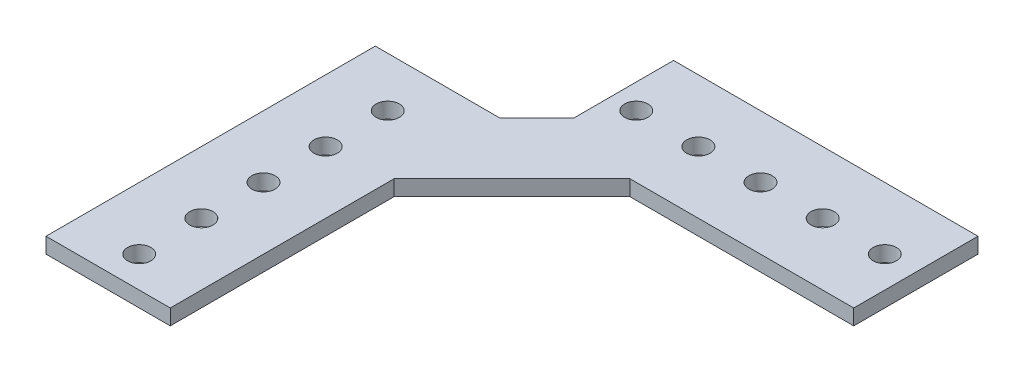
ISO-10303-21;
HEADER;
FILE_DESCRIPTION(('STEP AP214'),'2;1');
FILE_NAME('part.step','',(''),(''),'','','');
FILE_SCHEMA(('AUTOMOTIVE_DESIGN { 1 0 10303 214 1 1 1 1 }'));
ENDSEC;
DATA;
#1=APPLICATION_CONTEXT('core data for automotive mechanical design processes');
#2=APPLICATION_PROTOCOL_DEFINITION('international standard','automotive_design',2000,#1);
#3=PRODUCT_CONTEXT('',#1,'mechanical');
#4=PRODUCT('Part','Part','',(#3));
#5=PRODUCT_RELATED_PRODUCT_CATEGORY('part','',(#4));
#6=PRODUCT_DEFINITION_FORMATION('','',#4);
#7=PRODUCT_DEFINITION_CONTEXT('part definition',#1,'design');
#8=PRODUCT_DEFINITION('design','',#6,#7);
#9=PRODUCT_DEFINITION_SHAPE('','',#8);
#10=(LENGTH_UNIT() NAMED_UNIT(*) SI_UNIT(.MILLI.,.METRE.));
#11=(NAMED_UNIT(*) PLANE_ANGLE_UNIT() SI_UNIT($,.RADIAN.));
#12=(NAMED_UNIT(*) SI_UNIT($,.STERADIAN.) SOLID_ANGLE_UNIT());
#13=UNCERTAINTY_MEASURE_WITH_UNIT(LENGTH_MEASURE(1.E-05),#10,'distance_accuracy_value','');
#14=(GEOMETRIC_REPRESENTATION_CONTEXT(3) GLOBAL_UNCERTAINTY_ASSIGNED_CONTEXT((#13)) GLOBAL_UNIT_ASSIGNED_CONTEXT((#10,
#11,#12)) REPRESENTATION_CONTEXT('',''));
#15=CARTESIAN_POINT('',(0.,0.,0.));
#16=DIRECTION('',(0.,0.,1.));
#17=DIRECTION('',(1.,0.,0.));
#18=AXIS2_PLACEMENT_3D('',#15,#16,#17);
#19=CARTESIAN_POINT('',(0.,3.175,0.));
#20=DIRECTION('',(1.,0.,0.));
#21=DIRECTION('',(0.,0.,-1.));
#22=AXIS2_PLACEMENT_3D('',#19,#20,#21);
#23=PLANE('',#22);
#24=DIRECTION('',(0.,0.,1.));
#25=VECTOR('',#24,1.);
#26=CARTESIAN_POINT('',(0.,0.,0.));
#27=LINE('',#26,#25);
#28=CARTESIAN_POINT('',(0.,0.,-67.31));
#29=VERTEX_POINT('',#28);
#30=CARTESIAN_POINT('',(0.,0.,0.));
#31=VERTEX_POINT('',#30);
#32=EDGE_CURVE('E204',#29,#31,#27,.T.);
#33=ORIENTED_EDGE('',*,*,#32,.T.);
#34=DIRECTION('',(0.,-1.,0.));
#35=VECTOR('',#34,1.);
#36=CARTESIAN_POINT('',(0.,3.175,0.));
#37=LINE('',#36,#35);
#38=CARTESIAN_POINT('',(0.,3.175,0.));
#39=VERTEX_POINT('',#38);
#40=EDGE_CURVE('E11',#39,#31,#37,.T.);
#41=ORIENTED_EDGE('',*,*,#40,.F.);
#42=DIRECTION('',(0.,0.,1.));
#43=VECTOR('',#42,1.);
#44=CARTESIAN_POINT('',(0.,3.175,0.));
#45=LINE('',#44,#43);
#46=CARTESIAN_POINT('',(0.,3.175,-67.31));
#47=VERTEX_POINT('',#46);
#48=EDGE_CURVE('E563',#47,#39,#45,.T.);
#49=ORIENTED_EDGE('',*,*,#48,.F.);
#50=DIRECTION('',(0.,-1.,0.));
#51=VECTOR('',#50,1.);
#52=CARTESIAN_POINT('',(0.,3.175,-67.31));
#53=LINE('',#52,#51);
#54=EDGE_CURVE('E67',#47,#29,#53,.T.);
#55=ORIENTED_EDGE('',*,*,#54,.T.);
#56=EDGE_LOOP('',(#33,#41,#49,#55));
#57=FACE_BOUND('',#56,.T.);
#58=ADVANCED_FACE('F49',(#57),#23,.F.);
#59=CARTESIAN_POINT('',(0.,3.175,0.));
#60=DIRECTION('',(0.,0.,-1.));
#61=DIRECTION('',(-1.,0.,0.));
#62=AXIS2_PLACEMENT_3D('',#59,#60,#61);
#63=PLANE('',#62);
#64=DIRECTION('',(1.,0.,0.));
#65=VECTOR('',#64,1.);
#66=CARTESIAN_POINT('',(0.,0.,0.));
#67=LINE('',#66,#65);
#68=CARTESIAN_POINT('',(25.4,0.,0.));
#69=VERTEX_POINT('',#68);
#70=EDGE_CURVE('E207',#31,#69,#67,.T.);
#71=ORIENTED_EDGE('',*,*,#70,.T.);
#72=DIRECTION('',(0.,-1.,0.));
#73=VECTOR('',#72,1.);
#74=CARTESIAN_POINT('',(25.4,3.175,0.));
#75=LINE('',#74,#73);
#76=CARTESIAN_POINT('',(25.4,3.175,0.));
#77=VERTEX_POINT('',#76);
#78=EDGE_CURVE('E59',#77,#69,#75,.T.);
#79=ORIENTED_EDGE('',*,*,#78,.F.);
#80=DIRECTION('',(1.,0.,0.));
#81=VECTOR('',#80,1.);
#82=CARTESIAN_POINT('',(0.,3.175,0.));
#83=LINE('',#82,#81);
#84=EDGE_CURVE('E111',#39,#77,#83,.T.);
#85=ORIENTED_EDGE('',*,*,#84,.F.);
#86=ORIENTED_EDGE('',*,*,#40,.T.);
#87=EDGE_LOOP('',(#71,#79,#85,#86));
#88=FACE_BOUND('',#87,.T.);
#89=ADVANCED_FACE('F307',(#88),#63,.F.);
#90=CARTESIAN_POINT('',(25.4,3.175,-1.32886804761116E-13));
#91=DIRECTION('',(-1.,0.,0.));
#92=DIRECTION('',(0.,0.,1.));
#93=AXIS2_PLACEMENT_3D('',#90,#91,#92);
#94=PLANE('',#93);
#95=DIRECTION('',(0.,0.,-1.));
#96=VECTOR('',#95,1.);
#97=CARTESIAN_POINT('',(25.4,0.,-1.32886804761116E-13));
#98=LINE('',#97,#96);
#99=CARTESIAN_POINT('',(25.3999999999997,0.,-45.7573853094339));
#100=VERTEX_POINT('',#99);
#101=EDGE_CURVE('E210',#69,#100,#98,.T.);
#102=ORIENTED_EDGE('',*,*,#101,.T.);
#103=DIRECTION('',(0.,-1.,0.));
#104=VECTOR('',#103,1.);
#105=CARTESIAN_POINT('',(25.3999999999997,3.175,-45.7573853094339));
#106=LINE('',#105,#104);
#107=CARTESIAN_POINT('',(25.3999999999997,3.175,-45.7573853094339));
#108=VERTEX_POINT('',#107);
#109=EDGE_CURVE('E254',#108,#100,#106,.T.);
#110=ORIENTED_EDGE('',*,*,#109,.F.);
#111=DIRECTION('',(0.,0.,-1.));
#112=VECTOR('',#111,1.);
#113=CARTESIAN_POINT('',(25.4,3.175,-1.32886804761116E-13));
#114=LINE('',#113,#112);
#115=EDGE_CURVE('E264',#77,#108,#114,.T.);
#116=ORIENTED_EDGE('',*,*,#115,.F.);
#117=ORIENTED_EDGE('',*,*,#78,.T.);
#118=EDGE_LOOP('',(#102,#110,#116,#117));
#119=FACE_BOUND('',#118,.T.);
#120=ADVANCED_FACE('F262',(#119),#94,.F.);
#121=CARTESIAN_POINT('',(-10.1786926547173,3.175,-10.1786926547174));
#122=DIRECTION('',(-0.707106781186543,0.,-0.707106781186552));
#123=DIRECTION('',(-0.707106781186552,0.,0.707106781186543));
#124=AXIS2_PLACEMENT_3D('',#121,#122,#123);
#125=PLANE('',#124);
#126=DIRECTION('',(0.707106781186552,0.,-0.707106781186543));
#127=VECTOR('',#126,1.);
#128=CARTESIAN_POINT('',(-10.1786926547173,0.,-10.1786926547174));
#129=LINE('',#128,#127);
#130=CARTESIAN_POINT('',(49.4926146905662,0.,-69.8500000000001));
#131=VERTEX_POINT('',#130);
#132=EDGE_CURVE('E213',#100,#131,#129,.T.);
#133=ORIENTED_EDGE('',*,*,#132,.T.);
#134=DIRECTION('',(0.,-1.,0.));
#135=VECTOR('',#134,1.);
#136=CARTESIAN_POINT('',(49.4926146905662,3.175,-69.8500000000001));
#137=LINE('',#136,#135);
#138=CARTESIAN_POINT('',(49.4926146905662,3.175,-69.8500000000001));
#139=VERTEX_POINT('',#138);
#140=EDGE_CURVE('E250',#139,#131,#137,.T.);
#141=ORIENTED_EDGE('',*,*,#140,.F.);
#142=DIRECTION('',(0.707106781186552,0.,-0.707106781186543));
#143=VECTOR('',#142,1.);
#144=CARTESIAN_POINT('',(-10.1786926547173,3.175,-10.1786926547174));
#145=LINE('',#144,#143);
#146=EDGE_CURVE('E281',#108,#139,#145,.T.);
#147=ORIENTED_EDGE('',*,*,#146,.F.);
#148=ORIENTED_EDGE('',*,*,#109,.T.);
#149=EDGE_LOOP('',(#133,#141,#147,#148));
#150=FACE_BOUND('',#149,.T.);
#151=ADVANCED_FACE('F271',(#150),#125,.F.);
#152=CARTESIAN_POINT('',(0.,3.175,-69.8500000000001));
#153=DIRECTION('',(0.,0.,-1.));
#154=DIRECTION('',(-1.,0.,0.));
#155=AXIS2_PLACEMENT_3D('',#152,#153,#154);
#156=PLANE('',#155);
#157=DIRECTION('',(1.,0.,0.));
#158=VECTOR('',#157,1.);
#159=CARTESIAN_POINT('',(0.,0.,-69.8500000000001));
#160=LINE('',#159,#158);
#161=CARTESIAN_POINT('',(95.2499999999999,0.,-69.8500000000001));
#162=VERTEX_POINT('',#161);
#163=EDGE_CURVE('E216',#131,#162,#160,.T.);
#164=ORIENTED_EDGE('',*,*,#163,.T.);
#165=DIRECTION('',(0.,-1.,0.));
#166=VECTOR('',#165,1.);
#167=CARTESIAN_POINT('',(95.2499999999999,3.175,-69.8500000000001));
#168=LINE('',#167,#166);
#169=CARTESIAN_POINT('',(95.2499999999999,3.175,-69.8500000000001));
#170=VERTEX_POINT('',#169);
#171=EDGE_CURVE('E247',#170,#162,#168,.T.);
#172=ORIENTED_EDGE('',*,*,#171,.F.);
#173=DIRECTION('',(1.,0.,0.));
#174=VECTOR('',#173,1.);
#175=CARTESIAN_POINT('',(0.,3.175,-69.8500000000001));
#176=LINE('',#175,#174);
#177=EDGE_CURVE('E277',#139,#170,#176,.T.);
#178=ORIENTED_EDGE('',*,*,#177,.F.);
#179=ORIENTED_EDGE('',*,*,#140,.T.);
#180=EDGE_LOOP('',(#164,#172,#178,#179));
#181=FACE_BOUND('',#180,.T.);
#182=ADVANCED_FACE('F275',(#181),#156,.F.);
#183=CARTESIAN_POINT('',(95.2499999999999,3.175,0.));
#184=DIRECTION('',(1.,0.,0.));
#185=DIRECTION('',(0.,0.,-1.));
#186=AXIS2_PLACEMENT_3D('',#183,#184,#185);
#187=PLANE('',#186);
#188=DIRECTION('',(0.,0.,1.));
#189=VECTOR('',#188,1.);
#190=CARTESIAN_POINT('',(95.2499999999999,0.,0.));
#191=LINE('',#190,#189);
#192=CARTESIAN_POINT('',(95.2499999999999,0.,-95.2500000000002));
#193=VERTEX_POINT('',#192);
#194=EDGE_CURVE('E220',#193,#162,#191,.T.);
#195=ORIENTED_EDGE('',*,*,#194,.F.);
#196=DIRECTION('',(0.,-1.,0.));
#197=VECTOR('',#196,1.);
#198=CARTESIAN_POINT('',(95.2499999999999,3.175,-95.2500000000002));
#199=LINE('',#198,#197);
#200=CARTESIAN_POINT('',(95.2499999999999,3.175,-95.2500000000002));
#201=VERTEX_POINT('',#200);
#202=EDGE_CURVE('E244',#201,#193,#199,.T.);
#203=ORIENTED_EDGE('',*,*,#202,.F.);
#204=DIRECTION('',(0.,0.,1.));
#205=VECTOR('',#204,1.);
#206=CARTESIAN_POINT('',(95.2499999999999,3.175,0.));
#207=LINE('',#206,#205);
#208=EDGE_CURVE('E280',#201,#170,#207,.T.);
#209=ORIENTED_EDGE('',*,*,#208,.T.);
#210=ORIENTED_EDGE('',*,*,#171,.T.);
#211=EDGE_LOOP('',(#195,#203,#209,#210));
#212=FACE_BOUND('',#211,.T.);
#213=ADVANCED_FACE('F478',(#212),#187,.T.);
#214=CARTESIAN_POINT('',(0.,3.175,-95.2500000000002));
#215=DIRECTION('',(0.,0.,-1.));
#216=DIRECTION('',(-1.,0.,0.));
#217=AXIS2_PLACEMENT_3D('',#214,#215,#216);
#218=PLANE('',#217);
#219=DIRECTION('',(1.,0.,0.));
#220=VECTOR('',#219,1.);
#221=CARTESIAN_POINT('',(0.,0.,-95.2500000000002));
#222=LINE('',#221,#220);
#223=CARTESIAN_POINT('',(33.02,0.,-95.2500000000002));
#224=VERTEX_POINT('',#223);
#225=EDGE_CURVE('E224',#224,#193,#222,.T.);
#226=ORIENTED_EDGE('',*,*,#225,.F.);
#227=DIRECTION('',(0.,-1.,0.));
#228=VECTOR('',#227,1.);
#229=CARTESIAN_POINT('',(33.02,3.175,-95.2500000000002));
#230=LINE('',#229,#228);
#231=CARTESIAN_POINT('',(33.02,3.175,-95.2500000000002));
#232=VERTEX_POINT('',#231);
#233=EDGE_CURVE('E154',#232,#224,#230,.T.);
#234=ORIENTED_EDGE('',*,*,#233,.F.);
#235=DIRECTION('',(1.,0.,0.));
#236=VECTOR('',#235,1.);
#237=CARTESIAN_POINT('',(0.,3.175,-95.2500000000002));
#238=LINE('',#237,#236);
#239=EDGE_CURVE('E142',#232,#201,#238,.T.);
#240=ORIENTED_EDGE('',*,*,#239,.T.);
#241=ORIENTED_EDGE('',*,*,#202,.T.);
#242=EDGE_LOOP('',(#226,#234,#240,#241));
#243=FACE_BOUND('',#242,.T.);
#244=ADVANCED_FACE('F291',(#243),#218,.T.);
#245=CARTESIAN_POINT('',(33.0199999999977,3.175,7.78023478975524E-13));
#246=DIRECTION('',(1.,0.,0.));
#247=DIRECTION('',(0.,0.,-1.));
#248=AXIS2_PLACEMENT_3D('',#245,#246,#247);
#249=PLANE('',#248);
#250=DIRECTION('',(0.,0.,1.));
#251=VECTOR('',#250,1.);
#252=CARTESIAN_POINT('',(33.0199999999977,0.,7.78023478975524E-13));
#253=LINE('',#252,#251);
#254=CARTESIAN_POINT('',(33.0199999999995,0.,-74.9299999999997));
#255=VERTEX_POINT('',#254);
#256=EDGE_CURVE('E150',#224,#255,#253,.T.);
#257=ORIENTED_EDGE('',*,*,#256,.T.);
#258=DIRECTION('',(0.,-1.,0.));
#259=VECTOR('',#258,1.);
#260=CARTESIAN_POINT('',(33.0199999999995,3.175,-74.9299999999997));
#261=LINE('',#260,#259);
#262=CARTESIAN_POINT('',(33.0199999999995,3.175,-74.9299999999997));
#263=VERTEX_POINT('',#262);
#264=EDGE_CURVE('E147',#263,#255,#261,.T.);
#265=ORIENTED_EDGE('',*,*,#264,.F.);
#266=DIRECTION('',(0.,0.,1.));
#267=VECTOR('',#266,1.);
#268=CARTESIAN_POINT('',(33.0199999999977,3.175,7.78023478975524E-13));
#269=LINE('',#268,#267);
#270=EDGE_CURVE('E134',#232,#263,#269,.T.);
#271=ORIENTED_EDGE('',*,*,#270,.F.);
#272=ORIENTED_EDGE('',*,*,#233,.T.);
#273=EDGE_LOOP('',(#257,#265,#271,#272));
#274=FACE_BOUND('',#273,.T.);
#275=ADVANCED_FACE('F148',(#274),#249,.F.);
#276=CARTESIAN_POINT('',(-20.9549999999998,3.175,-20.9549999999995));
#277=DIRECTION('',(-0.707106781186553,0.,-0.707106781186542));
#278=DIRECTION('',(-0.707106781186542,0.,0.707106781186553));
#279=AXIS2_PLACEMENT_3D('',#276,#277,#278);
#280=PLANE('',#279);
#281=DIRECTION('',(0.707106781186542,0.,-0.707106781186553));
#282=VECTOR('',#281,1.);
#283=CARTESIAN_POINT('',(-20.9549999999998,0.,-20.9549999999995));
#284=LINE('',#283,#282);
#285=CARTESIAN_POINT('',(25.4,0.,-67.31));
#286=VERTEX_POINT('',#285);
#287=EDGE_CURVE('E230',#286,#255,#284,.T.);
#288=ORIENTED_EDGE('',*,*,#287,.F.);
#289=DIRECTION('',(0.,-1.,0.));
#290=VECTOR('',#289,1.);
#291=CARTESIAN_POINT('',(25.4,3.175,-67.31));
#292=LINE('',#291,#290);
#293=CARTESIAN_POINT('',(25.4,3.175,-67.31));
#294=VERTEX_POINT('',#293);
#295=EDGE_CURVE('E99',#294,#286,#292,.T.);
#296=ORIENTED_EDGE('',*,*,#295,.F.);
#297=DIRECTION('',(0.707106781186542,0.,-0.707106781186553));
#298=VECTOR('',#297,1.);
#299=CARTESIAN_POINT('',(-20.9549999999998,3.175,-20.9549999999995));
#300=LINE('',#299,#298);
#301=EDGE_CURVE('E139',#294,#263,#300,.T.);
#302=ORIENTED_EDGE('',*,*,#301,.T.);
#303=ORIENTED_EDGE('',*,*,#264,.T.);
#304=EDGE_LOOP('',(#288,#296,#302,#303));
#305=FACE_BOUND('',#304,.T.);
#306=ADVANCED_FACE('F156',(#305),#280,.T.);
#307=CARTESIAN_POINT('',(38.0999999999999,3.175,-82.5500000000002));
#308=DIRECTION('',(0.,-1.,0.));
#309=DIRECTION('',(0.,0.,-1.));
#310=AXIS2_PLACEMENT_3D('',#307,#308,#309);
#311=CYLINDRICAL_SURFACE('',#310,2.38125);
#312=CARTESIAN_POINT('',(38.0999999999999,3.175,-82.5500000000002));
#313=DIRECTION('',(0.,1.,0.));
#314=DIRECTION('',(0.,0.,1.));
#315=AXIS2_PLACEMENT_3D('',#312,#313,#314);
#316=CIRCLE('',#315,2.38125);
#317=CARTESIAN_POINT('',(38.0999999999999,3.175,-80.1687500000002));
#318=VERTEX_POINT('',#317);
#319=EDGE_CURVE('E559',#318,#318,#316,.T.);
#320=ORIENTED_EDGE('',*,*,#319,.T.);
#321=EDGE_LOOP('',(#320));
#322=FACE_BOUND('',#321,.T.);
#323=CARTESIAN_POINT('',(38.0999999999999,0.,-82.5500000000002));
#324=DIRECTION('',(0.,1.,0.));
#325=DIRECTION('',(0.,0.,1.));
#326=AXIS2_PLACEMENT_3D('',#323,#324,#325);
#327=CIRCLE('',#326,2.38125);
#328=CARTESIAN_POINT('',(38.0999999999999,0.,-80.1687500000002));
#329=VERTEX_POINT('',#328);
#330=EDGE_CURVE('E200',#329,#329,#327,.T.);
#331=ORIENTED_EDGE('',*,*,#330,.F.);
#332=EDGE_LOOP('',(#331));
#333=FACE_BOUND('',#332,.T.);
#334=ADVANCED_FACE('F315',(#322,#333),#311,.F.);
#335=CARTESIAN_POINT('',(12.7,3.175,-57.15));
#336=DIRECTION('',(0.,-1.,0.));
#337=DIRECTION('',(0.,0.,-1.));
#338=AXIS2_PLACEMENT_3D('',#335,#336,#337);
#339=CYLINDRICAL_SURFACE('',#338,2.38125);
#340=CARTESIAN_POINT('',(12.7,3.175,-57.15));
#341=DIRECTION('',(0.,1.,0.));
#342=DIRECTION('',(0.,0.,1.));
#343=AXIS2_PLACEMENT_3D('',#340,#341,#342);
#344=CIRCLE('',#343,2.38125);
#345=CARTESIAN_POINT('',(12.7,3.175,-54.76875));
#346=VERTEX_POINT('',#345);
#347=EDGE_CURVE('E555',#346,#346,#344,.T.);
#348=ORIENTED_EDGE('',*,*,#347,.T.);
#349=EDGE_LOOP('',(#348));
#350=FACE_BOUND('',#349,.T.);
#351=CARTESIAN_POINT('',(12.7,0.,-57.15));
#352=DIRECTION('',(0.,1.,0.));
#353=DIRECTION('',(0.,0.,1.));
#354=AXIS2_PLACEMENT_3D('',#351,#352,#353);
#355=CIRCLE('',#354,2.38125);
#356=CARTESIAN_POINT('',(12.7,0.,-54.76875));
#357=VERTEX_POINT('',#356);
#358=EDGE_CURVE('E196',#357,#357,#355,.T.);
#359=ORIENTED_EDGE('',*,*,#358,.F.);
#360=EDGE_LOOP('',(#359));
#361=FACE_BOUND('',#360,.T.);
#362=ADVANCED_FACE('F318',(#350,#361),#339,.F.);
#363=CARTESIAN_POINT('',(50.7999999999999,3.175,-82.5500000000002));
#364=DIRECTION('',(0.,-1.,0.));
#365=DIRECTION('',(0.,0.,-1.));
#366=AXIS2_PLACEMENT_3D('',#363,#364,#365);
#367=CYLINDRICAL_SURFACE('',#366,2.38124999999999);
#368=CARTESIAN_POINT('',(50.7999999999999,3.175,-82.5500000000002));
#369=DIRECTION('',(0.,1.,0.));
#370=DIRECTION('',(0.,0.,1.));
#371=AXIS2_PLACEMENT_3D('',#368,#369,#370);
#372=CIRCLE('',#371,2.38124999999999);
#373=CARTESIAN_POINT('',(50.7999999999999,3.175,-80.1687500000002));
#374=VERTEX_POINT('',#373);
#375=EDGE_CURVE('E551',#374,#374,#372,.T.);
#376=ORIENTED_EDGE('',*,*,#375,.T.);
#377=EDGE_LOOP('',(#376));
#378=FACE_BOUND('',#377,.T.);
#379=CARTESIAN_POINT('',(50.7999999999999,0.,-82.5500000000002));
#380=DIRECTION('',(0.,1.,0.));
#381=DIRECTION('',(0.,0.,1.));
#382=AXIS2_PLACEMENT_3D('',#379,#380,#381);
#383=CIRCLE('',#382,2.38124999999999);
#384=CARTESIAN_POINT('',(50.7999999999999,0.,-80.1687500000002));
#385=VERTEX_POINT('',#384);
#386=EDGE_CURVE('E192',#385,#385,#383,.T.);
#387=ORIENTED_EDGE('',*,*,#386,.F.);
#388=EDGE_LOOP('',(#387));
#389=FACE_BOUND('',#388,.T.);
#390=ADVANCED_FACE('F322',(#378,#389),#367,.F.);
#391=CARTESIAN_POINT('',(63.4999999999999,3.175,-82.5500000000002));
#392=DIRECTION('',(0.,-1.,0.));
#393=DIRECTION('',(0.,0.,-1.));
#394=AXIS2_PLACEMENT_3D('',#391,#392,#393);
#395=CYLINDRICAL_SURFACE('',#394,2.38124999999999);
#396=CARTESIAN_POINT('',(63.4999999999999,3.175,-82.5500000000002));
#397=DIRECTION('',(0.,1.,0.));
#398=DIRECTION('',(0.,0.,1.));
#399=AXIS2_PLACEMENT_3D('',#396,#397,#398);
#400=CIRCLE('',#399,2.38124999999999);
#401=CARTESIAN_POINT('',(63.4999999999999,3.175,-80.1687500000002));
#402=VERTEX_POINT('',#401);
#403=EDGE_CURVE('E547',#402,#402,#400,.T.);
#404=ORIENTED_EDGE('',*,*,#403,.T.);
#405=EDGE_LOOP('',(#404));
#406=FACE_BOUND('',#405,.T.);
#407=CARTESIAN_POINT('',(63.4999999999999,0.,-82.5500000000002));
#408=DIRECTION('',(0.,1.,0.));
#409=DIRECTION('',(0.,0.,1.));
#410=AXIS2_PLACEMENT_3D('',#407,#408,#409);
#411=CIRCLE('',#410,2.38124999999999);
#412=CARTESIAN_POINT('',(63.4999999999999,0.,-80.1687500000002));
#413=VERTEX_POINT('',#412);
#414=EDGE_CURVE('E188',#413,#413,#411,.T.);
#415=ORIENTED_EDGE('',*,*,#414,.F.);
#416=EDGE_LOOP('',(#415));
#417=FACE_BOUND('',#416,.T.);
#418=ADVANCED_FACE('F326',(#406,#417),#395,.F.);
#419=CARTESIAN_POINT('',(76.1999999999999,3.175,-82.5500000000002));
#420=DIRECTION('',(0.,-1.,0.));
#421=DIRECTION('',(0.,0.,-1.));
#422=AXIS2_PLACEMENT_3D('',#419,#420,#421);
#423=CYLINDRICAL_SURFACE('',#422,2.38125);
#424=CARTESIAN_POINT('',(76.1999999999999,3.175,-82.5500000000002));
#425=DIRECTION('',(0.,1.,0.));
#426=DIRECTION('',(0.,0.,1.));
#427=AXIS2_PLACEMENT_3D('',#424,#425,#426);
#428=CIRCLE('',#427,2.38125);
#429=CARTESIAN_POINT('',(76.1999999999999,3.175,-80.1687500000002));
#430=VERTEX_POINT('',#429);
#431=EDGE_CURVE('E543',#430,#430,#428,.T.);
#432=ORIENTED_EDGE('',*,*,#431,.T.);
#433=EDGE_LOOP('',(#432));
#434=FACE_BOUND('',#433,.T.);
#435=CARTESIAN_POINT('',(76.1999999999999,0.,-82.5500000000002));
#436=DIRECTION('',(0.,1.,0.));
#437=DIRECTION('',(0.,0.,1.));
#438=AXIS2_PLACEMENT_3D('',#435,#436,#437);
#439=CIRCLE('',#438,2.38125);
#440=CARTESIAN_POINT('',(76.1999999999999,0.,-80.1687500000002));
#441=VERTEX_POINT('',#440);
#442=EDGE_CURVE('E184',#441,#441,#439,.T.);
#443=ORIENTED_EDGE('',*,*,#442,.F.);
#444=EDGE_LOOP('',(#443));
#445=FACE_BOUND('',#444,.T.);
#446=ADVANCED_FACE('F330',(#434,#445),#423,.F.);
#447=CARTESIAN_POINT('',(88.8999999999999,3.175,-82.5500000000002));
#448=DIRECTION('',(0.,-1.,0.));
#449=DIRECTION('',(0.,0.,-1.));
#450=AXIS2_PLACEMENT_3D('',#447,#448,#449);
#451=CYLINDRICAL_SURFACE('',#450,2.38124999999999);
#452=CARTESIAN_POINT('',(88.8999999999999,3.175,-82.5500000000002));
#453=DIRECTION('',(0.,1.,0.));
#454=DIRECTION('',(0.,0.,1.));
#455=AXIS2_PLACEMENT_3D('',#452,#453,#454);
#456=CIRCLE('',#455,2.38124999999999);
#457=CARTESIAN_POINT('',(88.8999999999999,3.175,-80.1687500000002));
#458=VERTEX_POINT('',#457);
#459=EDGE_CURVE('E539',#458,#458,#456,.T.);
#460=ORIENTED_EDGE('',*,*,#459,.T.);
#461=EDGE_LOOP('',(#460));
#462=FACE_BOUND('',#461,.T.);
#463=CARTESIAN_POINT('',(88.8999999999999,0.,-82.5500000000002));
#464=DIRECTION('',(0.,1.,0.));
#465=DIRECTION('',(0.,0.,1.));
#466=AXIS2_PLACEMENT_3D('',#463,#464,#465);
#467=CIRCLE('',#466,2.38124999999999);
#468=CARTESIAN_POINT('',(88.8999999999999,0.,-80.1687500000002));
#469=VERTEX_POINT('',#468);
#470=EDGE_CURVE('E180',#469,#469,#467,.T.);
#471=ORIENTED_EDGE('',*,*,#470,.F.);
#472=EDGE_LOOP('',(#471));
#473=FACE_BOUND('',#472,.T.);
#474=ADVANCED_FACE('F334',(#462,#473),#451,.F.);
#475=CARTESIAN_POINT('',(12.7,3.175,-44.45));
#476=DIRECTION('',(0.,-1.,0.));
#477=DIRECTION('',(0.,0.,-1.));
#478=AXIS2_PLACEMENT_3D('',#475,#476,#477);
#479=CYLINDRICAL_SURFACE('',#478,2.38125);
#480=CARTESIAN_POINT('',(12.7,3.175,-44.45));
#481=DIRECTION('',(0.,1.,0.));
#482=DIRECTION('',(0.,0.,1.));
#483=AXIS2_PLACEMENT_3D('',#480,#481,#482);
#484=CIRCLE('',#483,2.38125);
#485=CARTESIAN_POINT('',(12.7,3.175,-42.06875));
#486=VERTEX_POINT('',#485);
#487=EDGE_CURVE('E531',#486,#486,#484,.T.);
#488=ORIENTED_EDGE('',*,*,#487,.T.);
#489=EDGE_LOOP('',(#488));
#490=FACE_BOUND('',#489,.T.);
#491=CARTESIAN_POINT('',(12.7,0.,-44.45));
#492=DIRECTION('',(0.,1.,0.));
#493=DIRECTION('',(0.,0.,1.));
#494=AXIS2_PLACEMENT_3D('',#491,#492,#493);
#495=CIRCLE('',#494,2.38125);
#496=CARTESIAN_POINT('',(12.7,0.,-42.06875));
#497=VERTEX_POINT('',#496);
#498=EDGE_CURVE('E176',#497,#497,#495,.T.);
#499=ORIENTED_EDGE('',*,*,#498,.F.);
#500=EDGE_LOOP('',(#499));
#501=FACE_BOUND('',#500,.T.);
#502=ADVANCED_FACE('F338',(#490,#501),#479,.F.);
#503=CARTESIAN_POINT('',(12.7,3.175,-31.75));
#504=DIRECTION('',(0.,-1.,0.));
#505=DIRECTION('',(0.,0.,-1.));
#506=AXIS2_PLACEMENT_3D('',#503,#504,#505);
#507=CYLINDRICAL_SURFACE('',#506,2.38125);
#508=CARTESIAN_POINT('',(12.7,3.175,-31.75));
#509=DIRECTION('',(0.,1.,0.));
#510=DIRECTION('',(0.,0.,1.));
#511=AXIS2_PLACEMENT_3D('',#508,#509,#510);
#512=CIRCLE('',#511,2.38125);
#513=CARTESIAN_POINT('',(12.7,3.175,-29.36875));
#514=VERTEX_POINT('',#513);
#515=EDGE_CURVE('E526',#514,#514,#512,.T.);
#516=ORIENTED_EDGE('',*,*,#515,.T.);
#517=EDGE_LOOP('',(#516));
#518=FACE_BOUND('',#517,.T.);
#519=CARTESIAN_POINT('',(12.7,0.,-31.75));
#520=DIRECTION('',(0.,1.,0.));
#521=DIRECTION('',(0.,0.,1.));
#522=AXIS2_PLACEMENT_3D('',#519,#520,#521);
#523=CIRCLE('',#522,2.38125);
#524=CARTESIAN_POINT('',(12.7,0.,-29.36875));
#525=VERTEX_POINT('',#524);
#526=EDGE_CURVE('E172',#525,#525,#523,.T.);
#527=ORIENTED_EDGE('',*,*,#526,.F.);
#528=EDGE_LOOP('',(#527));
#529=FACE_BOUND('',#528,.T.);
#530=ADVANCED_FACE('F342',(#518,#529),#507,.F.);
#531=CARTESIAN_POINT('',(12.7,3.175,-19.05));
#532=DIRECTION('',(0.,-1.,0.));
#533=DIRECTION('',(0.,0.,-1.));
#534=AXIS2_PLACEMENT_3D('',#531,#532,#533);
#535=CYLINDRICAL_SURFACE('',#534,2.38125);
#536=CARTESIAN_POINT('',(12.7,3.175,-19.05));
#537=DIRECTION('',(0.,1.,0.));
#538=DIRECTION('',(0.,0.,1.));
#539=AXIS2_PLACEMENT_3D('',#536,#537,#538);
#540=CIRCLE('',#539,2.38125);
#541=CARTESIAN_POINT('',(12.7,3.175,-16.66875));
#542=VERTEX_POINT('',#541);
#543=EDGE_CURVE('E353',#542,#542,#540,.T.);
#544=ORIENTED_EDGE('',*,*,#543,.T.);
#545=EDGE_LOOP('',(#544));
#546=FACE_BOUND('',#545,.T.);
#547=CARTESIAN_POINT('',(12.7,0.,-19.05));
#548=DIRECTION('',(0.,1.,0.));
#549=DIRECTION('',(0.,0.,1.));
#550=AXIS2_PLACEMENT_3D('',#547,#548,#549);
#551=CIRCLE('',#550,2.38125);
#552=CARTESIAN_POINT('',(12.7,0.,-16.66875));
#553=VERTEX_POINT('',#552);
#554=EDGE_CURVE('E168',#553,#553,#551,.T.);
#555=ORIENTED_EDGE('',*,*,#554,.F.);
#556=EDGE_LOOP('',(#555));
#557=FACE_BOUND('',#556,.T.);
#558=ADVANCED_FACE('F302',(#546,#557),#535,.F.);
#559=CARTESIAN_POINT('',(12.7,3.175,-6.35000000000002));
#560=DIRECTION('',(0.,-1.,0.));
#561=DIRECTION('',(0.,0.,-1.));
#562=AXIS2_PLACEMENT_3D('',#559,#560,#561);
#563=CYLINDRICAL_SURFACE('',#562,2.38125);
#564=CARTESIAN_POINT('',(12.7,3.175,-6.35000000000002));
#565=DIRECTION('',(0.,1.,0.));
#566=DIRECTION('',(0.,0.,1.));
#567=AXIS2_PLACEMENT_3D('',#564,#565,#566);
#568=CIRCLE('',#567,2.38125);
#569=CARTESIAN_POINT('',(12.7,3.175,-3.96875000000002));
#570=VERTEX_POINT('',#569);
#571=EDGE_CURVE('E237',#570,#570,#568,.T.);
#572=ORIENTED_EDGE('',*,*,#571,.T.);
#573=EDGE_LOOP('',(#572));
#574=FACE_BOUND('',#573,.T.);
#575=CARTESIAN_POINT('',(12.7,0.,-6.35000000000002));
#576=DIRECTION('',(0.,1.,0.));
#577=DIRECTION('',(0.,0.,1.));
#578=AXIS2_PLACEMENT_3D('',#575,#576,#577);
#579=CIRCLE('',#578,2.38125);
#580=CARTESIAN_POINT('',(12.7,0.,-3.96875000000002));
#581=VERTEX_POINT('',#580);
#582=EDGE_CURVE('E164',#581,#581,#579,.T.);
#583=ORIENTED_EDGE('',*,*,#582,.F.);
#584=EDGE_LOOP('',(#583));
#585=FACE_BOUND('',#584,.T.);
#586=ADVANCED_FACE('F51',(#574,#585),#563,.F.);
#587=CARTESIAN_POINT('',(0.,3.175,-67.31));
#588=DIRECTION('',(0.,0.,-1.));
#589=DIRECTION('',(-1.,0.,0.));
#590=AXIS2_PLACEMENT_3D('',#587,#588,#589);
#591=PLANE('',#590);
#592=DIRECTION('',(1.,0.,0.));
#593=VECTOR('',#592,1.);
#594=CARTESIAN_POINT('',(0.,0.,-67.31));
#595=LINE('',#594,#593);
#596=EDGE_CURVE('E233',#29,#286,#595,.T.);
#597=ORIENTED_EDGE('',*,*,#596,.F.);
#598=ORIENTED_EDGE('',*,*,#54,.F.);
#599=DIRECTION('',(1.,0.,0.));
#600=VECTOR('',#599,1.);
#601=CARTESIAN_POINT('',(0.,3.175,-67.31));
#602=LINE('',#601,#600);
#603=EDGE_CURVE('E158',#47,#294,#602,.T.);
#604=ORIENTED_EDGE('',*,*,#603,.T.);
#605=ORIENTED_EDGE('',*,*,#295,.T.);
#606=EDGE_LOOP('',(#597,#598,#604,#605));
#607=FACE_BOUND('',#606,.T.);
#608=ADVANCED_FACE('F293',(#607),#591,.T.);
#609=CARTESIAN_POINT('',(0.,3.175,0.));
#610=DIRECTION('',(0.,1.,0.));
#611=DIRECTION('',(0.,0.,1.));
#612=AXIS2_PLACEMENT_3D('',#609,#610,#611);
#613=PLANE('',#612);
#614=ORIENTED_EDGE('',*,*,#571,.F.);
#615=EDGE_LOOP('',(#614));
#616=FACE_BOUND('',#615,.T.);
#617=ORIENTED_EDGE('',*,*,#543,.F.);
#618=EDGE_LOOP('',(#617));
#619=FACE_BOUND('',#618,.T.);
#620=ORIENTED_EDGE('',*,*,#515,.F.);
#621=EDGE_LOOP('',(#620));
#622=FACE_BOUND('',#621,.T.);
#623=ORIENTED_EDGE('',*,*,#487,.F.);
#624=EDGE_LOOP('',(#623));
#625=FACE_BOUND('',#624,.T.);
#626=ORIENTED_EDGE('',*,*,#459,.F.);
#627=EDGE_LOOP('',(#626));
#628=FACE_BOUND('',#627,.T.);
#629=ORIENTED_EDGE('',*,*,#431,.F.);
#630=EDGE_LOOP('',(#629));
#631=FACE_BOUND('',#630,.T.);
#632=ORIENTED_EDGE('',*,*,#403,.F.);
#633=EDGE_LOOP('',(#632));
#634=FACE_BOUND('',#633,.T.);
#635=ORIENTED_EDGE('',*,*,#375,.F.);
#636=EDGE_LOOP('',(#635));
#637=FACE_BOUND('',#636,.T.);
#638=ORIENTED_EDGE('',*,*,#347,.F.);
#639=EDGE_LOOP('',(#638));
#640=FACE_BOUND('',#639,.T.);
#641=ORIENTED_EDGE('',*,*,#319,.F.);
#642=EDGE_LOOP('',(#641));
#643=FACE_BOUND('',#642,.T.);
#644=ORIENTED_EDGE('',*,*,#48,.T.);
#645=ORIENTED_EDGE('',*,*,#84,.T.);
#646=ORIENTED_EDGE('',*,*,#115,.T.);
#647=ORIENTED_EDGE('',*,*,#146,.T.);
#648=ORIENTED_EDGE('',*,*,#177,.T.);
#649=ORIENTED_EDGE('',*,*,#208,.F.);
#650=ORIENTED_EDGE('',*,*,#239,.F.);
#651=ORIENTED_EDGE('',*,*,#270,.T.);
#652=ORIENTED_EDGE('',*,*,#301,.F.);
#653=ORIENTED_EDGE('',*,*,#603,.F.);
#654=EDGE_LOOP('',(#644,#645,#646,#647,#648,#649,#650,#651,#652,#653));
#655=FACE_BOUND('',#654,.T.);
#656=ADVANCED_FACE('F136',(#616,#619,#622,#625,#628,#631,#634,#637,#640,#643,#655),#613,.T.);
#657=CARTESIAN_POINT('',(0.,0.,0.));
#658=DIRECTION('',(0.,1.,0.));
#659=DIRECTION('',(0.,0.,1.));
#660=AXIS2_PLACEMENT_3D('',#657,#658,#659);
#661=PLANE('',#660);
#662=ORIENTED_EDGE('',*,*,#582,.T.);
#663=EDGE_LOOP('',(#662));
#664=FACE_BOUND('',#663,.T.);
#665=ORIENTED_EDGE('',*,*,#554,.T.);
#666=EDGE_LOOP('',(#665));
#667=FACE_BOUND('',#666,.T.);
#668=ORIENTED_EDGE('',*,*,#526,.T.);
#669=EDGE_LOOP('',(#668));
#670=FACE_BOUND('',#669,.T.);
#671=ORIENTED_EDGE('',*,*,#498,.T.);
#672=EDGE_LOOP('',(#671));
#673=FACE_BOUND('',#672,.T.);
#674=ORIENTED_EDGE('',*,*,#470,.T.);
#675=EDGE_LOOP('',(#674));
#676=FACE_BOUND('',#675,.T.);
#677=ORIENTED_EDGE('',*,*,#442,.T.);
#678=EDGE_LOOP('',(#677));
#679=FACE_BOUND('',#678,.T.);
#680=ORIENTED_EDGE('',*,*,#414,.T.);
#681=EDGE_LOOP('',(#680));
#682=FACE_BOUND('',#681,.T.);
#683=ORIENTED_EDGE('',*,*,#386,.T.);
#684=EDGE_LOOP('',(#683));
#685=FACE_BOUND('',#684,.T.);
#686=ORIENTED_EDGE('',*,*,#358,.T.);
#687=EDGE_LOOP('',(#686));
#688=FACE_BOUND('',#687,.T.);
#689=ORIENTED_EDGE('',*,*,#330,.T.);
#690=EDGE_LOOP('',(#689));
#691=FACE_BOUND('',#690,.T.);
#692=ORIENTED_EDGE('',*,*,#32,.F.);
#693=ORIENTED_EDGE('',*,*,#596,.T.);
#694=ORIENTED_EDGE('',*,*,#287,.T.);
#695=ORIENTED_EDGE('',*,*,#256,.F.);
#696=ORIENTED_EDGE('',*,*,#225,.T.);
#697=ORIENTED_EDGE('',*,*,#194,.T.);
#698=ORIENTED_EDGE('',*,*,#163,.F.);
#699=ORIENTED_EDGE('',*,*,#132,.F.);
#700=ORIENTED_EDGE('',*,*,#101,.F.);
#701=ORIENTED_EDGE('',*,*,#70,.F.);
#702=EDGE_LOOP('',(#692,#693,#694,#695,#696,#697,#698,#699,#700,#701));
#703=FACE_BOUND('',#702,.T.);
#704=ADVANCED_FACE('F267',(#664,#667,#670,#673,#676,#679,#682,#685,#688,#691,#703),#661,.F.);
#705=CLOSED_SHELL('',(#58,#89,#120,#151,#182,#213,#244,#275,#306,#334,#362,#390,#418,#446,#474,
#502,#530,#558,#586,#608,#656,#704));
#706=MANIFOLD_SOLID_BREP('B2',#705);
#707=ADVANCED_BREP_SHAPE_REPRESENTATION('',(#18,#706),#14);
#708=SHAPE_DEFINITION_REPRESENTATION(#9,#707);
ENDSEC;
END-ISO-10303-21;
